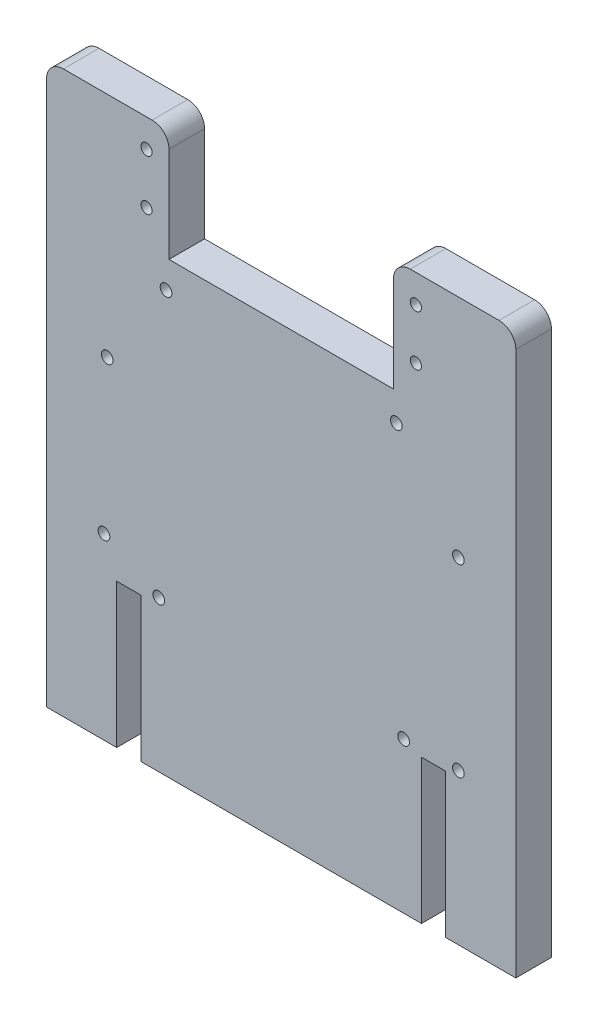
ISO-10303-21;
HEADER;
FILE_DESCRIPTION(('STEP AP214'),'2;1');
FILE_NAME('part.step','',(''),(''),'','','');
FILE_SCHEMA(('AUTOMOTIVE_DESIGN { 1 0 10303 214 1 1 1 1 }'));
ENDSEC;
DATA;
#1=APPLICATION_CONTEXT('core data for automotive mechanical design processes');
#2=APPLICATION_PROTOCOL_DEFINITION('international standard','automotive_design',2000,#1);
#3=PRODUCT_CONTEXT('',#1,'mechanical');
#4=PRODUCT('Part','Part','',(#3));
#5=PRODUCT_RELATED_PRODUCT_CATEGORY('part','',(#4));
#6=PRODUCT_DEFINITION_FORMATION('','',#4);
#7=PRODUCT_DEFINITION_CONTEXT('part definition',#1,'design');
#8=PRODUCT_DEFINITION('design','',#6,#7);
#9=PRODUCT_DEFINITION_SHAPE('','',#8);
#10=(LENGTH_UNIT() NAMED_UNIT(*) SI_UNIT(.MILLI.,.METRE.));
#11=(NAMED_UNIT(*) PLANE_ANGLE_UNIT() SI_UNIT($,.RADIAN.));
#12=(NAMED_UNIT(*) SI_UNIT($,.STERADIAN.) SOLID_ANGLE_UNIT());
#13=UNCERTAINTY_MEASURE_WITH_UNIT(LENGTH_MEASURE(1.E-05),#10,'distance_accuracy_value','');
#14=(GEOMETRIC_REPRESENTATION_CONTEXT(3) GLOBAL_UNCERTAINTY_ASSIGNED_CONTEXT((#13)) GLOBAL_UNIT_ASSIGNED_CONTEXT((#10,
#11,#12)) REPRESENTATION_CONTEXT('',''));
#15=CARTESIAN_POINT('',(0.,0.,0.));
#16=DIRECTION('',(0.,0.,1.));
#17=DIRECTION('',(1.,0.,0.));
#18=AXIS2_PLACEMENT_3D('',#15,#16,#17);
#19=CARTESIAN_POINT('',(12.5,0.,6.35));
#20=DIRECTION('',(0.,1.,0.));
#21=DIRECTION('',(-1.,0.,0.));
#22=AXIS2_PLACEMENT_3D('',#19,#20,#21);
#23=PLANE('',#22);
#24=DIRECTION('',(1.,0.,0.));
#25=VECTOR('',#24,1.);
#26=CARTESIAN_POINT('',(12.5,0.,0.));
#27=LINE('',#26,#25);
#28=CARTESIAN_POINT('',(0.,0.,0.));
#29=VERTEX_POINT('',#28);
#30=CARTESIAN_POINT('',(12.5,0.,0.));
#31=VERTEX_POINT('',#30);
#32=EDGE_CURVE('E200',#29,#31,#27,.T.);
#33=ORIENTED_EDGE('',*,*,#32,.T.);
#34=DIRECTION('',(0.,0.,-1.));
#35=VECTOR('',#34,1.);
#36=CARTESIAN_POINT('',(12.5,0.,6.35));
#37=LINE('',#36,#35);
#38=CARTESIAN_POINT('',(12.5,0.,6.35));
#39=VERTEX_POINT('',#38);
#40=EDGE_CURVE('E182',#39,#31,#37,.T.);
#41=ORIENTED_EDGE('',*,*,#40,.F.);
#42=DIRECTION('',(1.,0.,0.));
#43=VECTOR('',#42,1.);
#44=CARTESIAN_POINT('',(12.5,0.,6.35));
#45=LINE('',#44,#43);
#46=CARTESIAN_POINT('',(0.,0.,6.35));
#47=VERTEX_POINT('',#46);
#48=EDGE_CURVE('E188',#47,#39,#45,.T.);
#49=ORIENTED_EDGE('',*,*,#48,.F.);
#50=DIRECTION('',(0.,0.,-1.));
#51=VECTOR('',#50,1.);
#52=CARTESIAN_POINT('',(0.,0.,6.35));
#53=LINE('',#52,#51);
#54=EDGE_CURVE('E336',#47,#29,#53,.T.);
#55=ORIENTED_EDGE('',*,*,#54,.T.);
#56=EDGE_LOOP('',(#33,#41,#49,#55));
#57=FACE_BOUND('',#56,.T.);
#58=ADVANCED_FACE('F37',(#57),#23,.F.);
#59=CARTESIAN_POINT('',(12.5,0.,6.35));
#60=DIRECTION('',(-1.,0.,0.));
#61=DIRECTION('',(0.,0.,1.));
#62=AXIS2_PLACEMENT_3D('',#59,#60,#61);
#63=PLANE('',#62);
#64=DIRECTION('',(0.,1.,0.));
#65=VECTOR('',#64,1.);
#66=CARTESIAN_POINT('',(12.5,0.,0.));
#67=LINE('',#66,#65);
#68=CARTESIAN_POINT('',(12.5,25.68,0.));
#69=VERTEX_POINT('',#68);
#70=EDGE_CURVE('E338',#31,#69,#67,.T.);
#71=ORIENTED_EDGE('',*,*,#70,.T.);
#72=DIRECTION('',(0.,0.,-1.));
#73=VECTOR('',#72,1.);
#74=CARTESIAN_POINT('',(12.5,25.68,6.35));
#75=LINE('',#74,#73);
#76=CARTESIAN_POINT('',(12.5,25.68,6.35));
#77=VERTEX_POINT('',#76);
#78=EDGE_CURVE('E185',#77,#69,#75,.T.);
#79=ORIENTED_EDGE('',*,*,#78,.F.);
#80=DIRECTION('',(0.,1.,0.));
#81=VECTOR('',#80,1.);
#82=CARTESIAN_POINT('',(12.5,0.,6.35));
#83=LINE('',#82,#81);
#84=EDGE_CURVE('E178',#39,#77,#83,.T.);
#85=ORIENTED_EDGE('',*,*,#84,.F.);
#86=ORIENTED_EDGE('',*,*,#40,.T.);
#87=EDGE_LOOP('',(#71,#79,#85,#86));
#88=FACE_BOUND('',#87,.T.);
#89=ADVANCED_FACE('F180',(#88),#63,.F.);
#90=CARTESIAN_POINT('',(12.5,25.68,6.35));
#91=DIRECTION('',(0.,1.,0.));
#92=DIRECTION('',(0.,0.,1.));
#93=AXIS2_PLACEMENT_3D('',#90,#91,#92);
#94=PLANE('',#93);
#95=DIRECTION('',(1.,0.,0.));
#96=VECTOR('',#95,1.);
#97=CARTESIAN_POINT('',(12.5,25.68,0.));
#98=LINE('',#97,#96);
#99=CARTESIAN_POINT('',(16.818,25.68,0.));
#100=VERTEX_POINT('',#99);
#101=EDGE_CURVE('E340',#69,#100,#98,.T.);
#102=ORIENTED_EDGE('',*,*,#101,.T.);
#103=DIRECTION('',(0.,0.,-1.));
#104=VECTOR('',#103,1.);
#105=CARTESIAN_POINT('',(16.818,25.68,6.35));
#106=LINE('',#105,#104);
#107=CARTESIAN_POINT('',(16.818,25.68,6.35));
#108=VERTEX_POINT('',#107);
#109=EDGE_CURVE('E205',#108,#100,#106,.T.);
#110=ORIENTED_EDGE('',*,*,#109,.F.);
#111=DIRECTION('',(1.,0.,0.));
#112=VECTOR('',#111,1.);
#113=CARTESIAN_POINT('',(12.5,25.68,6.35));
#114=LINE('',#113,#112);
#115=EDGE_CURVE('E187',#77,#108,#114,.T.);
#116=ORIENTED_EDGE('',*,*,#115,.F.);
#117=ORIENTED_EDGE('',*,*,#78,.T.);
#118=EDGE_LOOP('',(#102,#110,#116,#117));
#119=FACE_BOUND('',#118,.T.);
#120=ADVANCED_FACE('F419',(#119),#94,.F.);
#121=CARTESIAN_POINT('',(16.818,25.68,6.35));
#122=DIRECTION('',(1.,0.,0.));
#123=DIRECTION('',(0.,0.,-1.));
#124=AXIS2_PLACEMENT_3D('',#121,#122,#123);
#125=PLANE('',#124);
#126=DIRECTION('',(0.,-1.,0.));
#127=VECTOR('',#126,1.);
#128=CARTESIAN_POINT('',(16.818,25.68,0.));
#129=LINE('',#128,#127);
#130=CARTESIAN_POINT('',(16.818,0.,0.));
#131=VERTEX_POINT('',#130);
#132=EDGE_CURVE('E342',#100,#131,#129,.T.);
#133=ORIENTED_EDGE('',*,*,#132,.T.);
#134=DIRECTION('',(0.,0.,-1.));
#135=VECTOR('',#134,1.);
#136=CARTESIAN_POINT('',(16.818,0.,6.35));
#137=LINE('',#136,#135);
#138=CARTESIAN_POINT('',(16.818,0.,6.35));
#139=VERTEX_POINT('',#138);
#140=EDGE_CURVE('E392',#139,#131,#137,.T.);
#141=ORIENTED_EDGE('',*,*,#140,.F.);
#142=DIRECTION('',(0.,-1.,0.));
#143=VECTOR('',#142,1.);
#144=CARTESIAN_POINT('',(16.818,25.68,6.35));
#145=LINE('',#144,#143);
#146=EDGE_CURVE('E309',#108,#139,#145,.T.);
#147=ORIENTED_EDGE('',*,*,#146,.F.);
#148=ORIENTED_EDGE('',*,*,#109,.T.);
#149=EDGE_LOOP('',(#133,#141,#147,#148));
#150=FACE_BOUND('',#149,.T.);
#151=ADVANCED_FACE('F399',(#150),#125,.F.);
#152=CARTESIAN_POINT('',(16.818,0.,6.35));
#153=DIRECTION('',(0.,1.,0.));
#154=DIRECTION('',(0.,0.,1.));
#155=AXIS2_PLACEMENT_3D('',#152,#153,#154);
#156=PLANE('',#155);
#157=DIRECTION('',(1.,0.,0.));
#158=VECTOR('',#157,1.);
#159=CARTESIAN_POINT('',(16.818,0.,0.));
#160=LINE('',#159,#158);
#161=CARTESIAN_POINT('',(66.818,0.,0.));
#162=VERTEX_POINT('',#161);
#163=EDGE_CURVE('E344',#131,#162,#160,.T.);
#164=ORIENTED_EDGE('',*,*,#163,.T.);
#165=DIRECTION('',(0.,0.,-1.));
#166=VECTOR('',#165,1.);
#167=CARTESIAN_POINT('',(66.818,0.,6.35));
#168=LINE('',#167,#166);
#169=CARTESIAN_POINT('',(66.818,0.,6.35));
#170=VERTEX_POINT('',#169);
#171=EDGE_CURVE('E389',#170,#162,#168,.T.);
#172=ORIENTED_EDGE('',*,*,#171,.F.);
#173=DIRECTION('',(1.,0.,0.));
#174=VECTOR('',#173,1.);
#175=CARTESIAN_POINT('',(16.818,0.,6.35));
#176=LINE('',#175,#174);
#177=EDGE_CURVE('E311',#139,#170,#176,.T.);
#178=ORIENTED_EDGE('',*,*,#177,.F.);
#179=ORIENTED_EDGE('',*,*,#140,.T.);
#180=EDGE_LOOP('',(#164,#172,#178,#179));
#181=FACE_BOUND('',#180,.T.);
#182=ADVANCED_FACE('F411',(#181),#156,.F.);
#183=CARTESIAN_POINT('',(66.818,0.,6.35));
#184=DIRECTION('',(-1.,0.,0.));
#185=DIRECTION('',(0.,0.,1.));
#186=AXIS2_PLACEMENT_3D('',#183,#184,#185);
#187=PLANE('',#186);
#188=DIRECTION('',(0.,1.,0.));
#189=VECTOR('',#188,1.);
#190=CARTESIAN_POINT('',(66.818,0.,0.));
#191=LINE('',#190,#189);
#192=CARTESIAN_POINT('',(66.818,25.68,0.));
#193=VERTEX_POINT('',#192);
#194=EDGE_CURVE('E346',#162,#193,#191,.T.);
#195=ORIENTED_EDGE('',*,*,#194,.T.);
#196=DIRECTION('',(0.,0.,-1.));
#197=VECTOR('',#196,1.);
#198=CARTESIAN_POINT('',(66.818,25.68,6.35));
#199=LINE('',#198,#197);
#200=CARTESIAN_POINT('',(66.818,25.68,6.35));
#201=VERTEX_POINT('',#200);
#202=EDGE_CURVE('E386',#201,#193,#199,.T.);
#203=ORIENTED_EDGE('',*,*,#202,.F.);
#204=DIRECTION('',(0.,1.,0.));
#205=VECTOR('',#204,1.);
#206=CARTESIAN_POINT('',(66.818,0.,6.35));
#207=LINE('',#206,#205);
#208=EDGE_CURVE('E313',#170,#201,#207,.T.);
#209=ORIENTED_EDGE('',*,*,#208,.F.);
#210=ORIENTED_EDGE('',*,*,#171,.T.);
#211=EDGE_LOOP('',(#195,#203,#209,#210));
#212=FACE_BOUND('',#211,.T.);
#213=ADVANCED_FACE('F415',(#212),#187,.F.);
#214=CARTESIAN_POINT('',(66.818,25.68,6.35));
#215=DIRECTION('',(0.,1.,0.));
#216=DIRECTION('',(0.,0.,1.));
#217=AXIS2_PLACEMENT_3D('',#214,#215,#216);
#218=PLANE('',#217);
#219=DIRECTION('',(1.,0.,0.));
#220=VECTOR('',#219,1.);
#221=CARTESIAN_POINT('',(66.818,25.68,0.));
#222=LINE('',#221,#220);
#223=CARTESIAN_POINT('',(71.136,25.68,0.));
#224=VERTEX_POINT('',#223);
#225=EDGE_CURVE('E348',#193,#224,#222,.T.);
#226=ORIENTED_EDGE('',*,*,#225,.T.);
#227=DIRECTION('',(0.,0.,-1.));
#228=VECTOR('',#227,1.);
#229=CARTESIAN_POINT('',(71.136,25.68,6.35));
#230=LINE('',#229,#228);
#231=CARTESIAN_POINT('',(71.136,25.68,6.35));
#232=VERTEX_POINT('',#231);
#233=EDGE_CURVE('E383',#232,#224,#230,.T.);
#234=ORIENTED_EDGE('',*,*,#233,.F.);
#235=DIRECTION('',(1.,0.,0.));
#236=VECTOR('',#235,1.);
#237=CARTESIAN_POINT('',(66.818,25.68,6.35));
#238=LINE('',#237,#236);
#239=EDGE_CURVE('E315',#201,#232,#238,.T.);
#240=ORIENTED_EDGE('',*,*,#239,.F.);
#241=ORIENTED_EDGE('',*,*,#202,.T.);
#242=EDGE_LOOP('',(#226,#234,#240,#241));
#243=FACE_BOUND('',#242,.T.);
#244=ADVANCED_FACE('F497',(#243),#218,.F.);
#245=CARTESIAN_POINT('',(71.136,25.68,6.35));
#246=DIRECTION('',(1.,0.,0.));
#247=DIRECTION('',(0.,0.,-1.));
#248=AXIS2_PLACEMENT_3D('',#245,#246,#247);
#249=PLANE('',#248);
#250=DIRECTION('',(0.,-1.,0.));
#251=VECTOR('',#250,1.);
#252=CARTESIAN_POINT('',(71.136,25.68,0.));
#253=LINE('',#252,#251);
#254=CARTESIAN_POINT('',(71.136,0.,0.));
#255=VERTEX_POINT('',#254);
#256=EDGE_CURVE('E350',#224,#255,#253,.T.);
#257=ORIENTED_EDGE('',*,*,#256,.T.);
#258=DIRECTION('',(0.,0.,-1.));
#259=VECTOR('',#258,1.);
#260=CARTESIAN_POINT('',(71.136,0.,6.35));
#261=LINE('',#260,#259);
#262=CARTESIAN_POINT('',(71.136,0.,6.35));
#263=VERTEX_POINT('',#262);
#264=EDGE_CURVE('E380',#263,#255,#261,.T.);
#265=ORIENTED_EDGE('',*,*,#264,.F.);
#266=DIRECTION('',(0.,-1.,0.));
#267=VECTOR('',#266,1.);
#268=CARTESIAN_POINT('',(71.136,25.68,6.35));
#269=LINE('',#268,#267);
#270=EDGE_CURVE('E317',#232,#263,#269,.T.);
#271=ORIENTED_EDGE('',*,*,#270,.F.);
#272=ORIENTED_EDGE('',*,*,#233,.T.);
#273=EDGE_LOOP('',(#257,#265,#271,#272));
#274=FACE_BOUND('',#273,.T.);
#275=ADVANCED_FACE('F493',(#274),#249,.F.);
#276=CARTESIAN_POINT('',(71.136,0.,6.35));
#277=DIRECTION('',(0.,1.,0.));
#278=DIRECTION('',(0.,0.,1.));
#279=AXIS2_PLACEMENT_3D('',#276,#277,#278);
#280=PLANE('',#279);
#281=DIRECTION('',(1.,0.,0.));
#282=VECTOR('',#281,1.);
#283=CARTESIAN_POINT('',(71.136,0.,0.));
#284=LINE('',#283,#282);
#285=CARTESIAN_POINT('',(83.636,0.,0.));
#286=VERTEX_POINT('',#285);
#287=EDGE_CURVE('E352',#255,#286,#284,.T.);
#288=ORIENTED_EDGE('',*,*,#287,.T.);
#289=DIRECTION('',(0.,0.,-1.));
#290=VECTOR('',#289,1.);
#291=CARTESIAN_POINT('',(83.636,0.,6.35));
#292=LINE('',#291,#290);
#293=CARTESIAN_POINT('',(83.636,0.,6.35));
#294=VERTEX_POINT('',#293);
#295=EDGE_CURVE('E377',#294,#286,#292,.T.);
#296=ORIENTED_EDGE('',*,*,#295,.F.);
#297=DIRECTION('',(1.,0.,0.));
#298=VECTOR('',#297,1.);
#299=CARTESIAN_POINT('',(71.136,0.,6.35));
#300=LINE('',#299,#298);
#301=EDGE_CURVE('E319',#263,#294,#300,.T.);
#302=ORIENTED_EDGE('',*,*,#301,.F.);
#303=ORIENTED_EDGE('',*,*,#264,.T.);
#304=EDGE_LOOP('',(#288,#296,#302,#303));
#305=FACE_BOUND('',#304,.T.);
#306=ADVANCED_FACE('F489',(#305),#280,.F.);
#307=CARTESIAN_POINT('',(83.636,100.,6.35));
#308=DIRECTION('',(-1.,0.,0.));
#309=DIRECTION('',(0.,0.,1.));
#310=AXIS2_PLACEMENT_3D('',#307,#308,#309);
#311=PLANE('',#310);
#312=DIRECTION('',(0.,1.,0.));
#313=VECTOR('',#312,1.);
#314=CARTESIAN_POINT('',(83.636,100.,0.));
#315=LINE('',#314,#313);
#316=CARTESIAN_POINT('',(83.636,97.,0.));
#317=VERTEX_POINT('',#316);
#318=EDGE_CURVE('E354',#286,#317,#315,.T.);
#319=ORIENTED_EDGE('',*,*,#318,.T.);
#320=DIRECTION('',(0.,0.,-1.));
#321=VECTOR('',#320,1.);
#322=CARTESIAN_POINT('',(83.636,97.,6.35));
#323=LINE('',#322,#321);
#324=CARTESIAN_POINT('',(83.636,97.,6.35));
#325=VERTEX_POINT('',#324);
#326=EDGE_CURVE('E219',#317,#325,#323,.F.);
#327=ORIENTED_EDGE('',*,*,#326,.T.);
#328=DIRECTION('',(0.,1.,0.));
#329=VECTOR('',#328,1.);
#330=CARTESIAN_POINT('',(83.636,100.,6.35));
#331=LINE('',#330,#329);
#332=EDGE_CURVE('E321',#294,#325,#331,.T.);
#333=ORIENTED_EDGE('',*,*,#332,.F.);
#334=ORIENTED_EDGE('',*,*,#295,.T.);
#335=EDGE_LOOP('',(#319,#327,#333,#334));
#336=FACE_BOUND('',#335,.T.);
#337=ADVANCED_FACE('F485',(#336),#311,.F.);
#338=CARTESIAN_POINT('',(61.818,100.,6.35));
#339=DIRECTION('',(0.,-1.,0.));
#340=DIRECTION('',(1.,0.,0.));
#341=AXIS2_PLACEMENT_3D('',#338,#339,#340);
#342=PLANE('',#341);
#343=DIRECTION('',(-1.,0.,0.));
#344=VECTOR('',#343,1.);
#345=CARTESIAN_POINT('',(61.818,100.,6.35));
#346=LINE('',#345,#344);
#347=CARTESIAN_POINT('',(80.636,100.,6.35));
#348=VERTEX_POINT('',#347);
#349=CARTESIAN_POINT('',(64.818,100.,6.35));
#350=VERTEX_POINT('',#349);
#351=EDGE_CURVE('E323',#348,#350,#346,.T.);
#352=ORIENTED_EDGE('',*,*,#351,.F.);
#353=DIRECTION('',(0.,0.,-1.));
#354=VECTOR('',#353,1.);
#355=CARTESIAN_POINT('',(80.636,100.,6.35));
#356=LINE('',#355,#354);
#357=CARTESIAN_POINT('',(80.636,100.,0.));
#358=VERTEX_POINT('',#357);
#359=EDGE_CURVE('E203',#348,#358,#356,.T.);
#360=ORIENTED_EDGE('',*,*,#359,.T.);
#361=DIRECTION('',(-1.,0.,0.));
#362=VECTOR('',#361,1.);
#363=CARTESIAN_POINT('',(61.818,100.,0.));
#364=LINE('',#363,#362);
#365=CARTESIAN_POINT('',(64.818,100.,0.));
#366=VERTEX_POINT('',#365);
#367=EDGE_CURVE('E357',#358,#366,#364,.T.);
#368=ORIENTED_EDGE('',*,*,#367,.T.);
#369=DIRECTION('',(0.,0.,-1.));
#370=VECTOR('',#369,1.);
#371=CARTESIAN_POINT('',(64.818,100.,6.35));
#372=LINE('',#371,#370);
#373=EDGE_CURVE('E201',#366,#350,#372,.F.);
#374=ORIENTED_EDGE('',*,*,#373,.T.);
#375=EDGE_LOOP('',(#352,#360,#368,#374));
#376=FACE_BOUND('',#375,.T.);
#377=ADVANCED_FACE('F481',(#376),#342,.F.);
#378=CARTESIAN_POINT('',(61.818,80.,6.35));
#379=DIRECTION('',(1.,0.,0.));
#380=DIRECTION('',(0.,0.,-1.));
#381=AXIS2_PLACEMENT_3D('',#378,#379,#380);
#382=PLANE('',#381);
#383=DIRECTION('',(0.,-1.,0.));
#384=VECTOR('',#383,1.);
#385=CARTESIAN_POINT('',(61.818,80.,6.35));
#386=LINE('',#385,#384);
#387=CARTESIAN_POINT('',(61.818,97.,6.35));
#388=VERTEX_POINT('',#387);
#389=CARTESIAN_POINT('',(61.818,80.,6.35));
#390=VERTEX_POINT('',#389);
#391=EDGE_CURVE('E326',#388,#390,#386,.T.);
#392=ORIENTED_EDGE('',*,*,#391,.F.);
#393=DIRECTION('',(0.,0.,-1.));
#394=VECTOR('',#393,1.);
#395=CARTESIAN_POINT('',(61.818,97.,6.35));
#396=LINE('',#395,#394);
#397=CARTESIAN_POINT('',(61.818,97.,0.));
#398=VERTEX_POINT('',#397);
#399=EDGE_CURVE('E228',#388,#398,#396,.T.);
#400=ORIENTED_EDGE('',*,*,#399,.T.);
#401=DIRECTION('',(0.,-1.,0.));
#402=VECTOR('',#401,1.);
#403=CARTESIAN_POINT('',(61.818,80.,0.));
#404=LINE('',#403,#402);
#405=CARTESIAN_POINT('',(61.818,80.,0.));
#406=VERTEX_POINT('',#405);
#407=EDGE_CURVE('E360',#398,#406,#404,.T.);
#408=ORIENTED_EDGE('',*,*,#407,.T.);
#409=DIRECTION('',(0.,0.,-1.));
#410=VECTOR('',#409,1.);
#411=CARTESIAN_POINT('',(61.818,80.,6.35));
#412=LINE('',#411,#410);
#413=EDGE_CURVE('E374',#390,#406,#412,.T.);
#414=ORIENTED_EDGE('',*,*,#413,.F.);
#415=EDGE_LOOP('',(#392,#400,#408,#414));
#416=FACE_BOUND('',#415,.T.);
#417=ADVANCED_FACE('F477',(#416),#382,.F.);
#418=CARTESIAN_POINT('',(21.818,80.,6.35));
#419=DIRECTION('',(0.,-1.,0.));
#420=DIRECTION('',(0.,0.,-1.));
#421=AXIS2_PLACEMENT_3D('',#418,#419,#420);
#422=PLANE('',#421);
#423=DIRECTION('',(-1.,0.,0.));
#424=VECTOR('',#423,1.);
#425=CARTESIAN_POINT('',(21.818,80.,0.));
#426=LINE('',#425,#424);
#427=CARTESIAN_POINT('',(21.818,80.,0.));
#428=VERTEX_POINT('',#427);
#429=EDGE_CURVE('E362',#406,#428,#426,.T.);
#430=ORIENTED_EDGE('',*,*,#429,.T.);
#431=DIRECTION('',(0.,0.,-1.));
#432=VECTOR('',#431,1.);
#433=CARTESIAN_POINT('',(21.818,80.,6.35));
#434=LINE('',#433,#432);
#435=CARTESIAN_POINT('',(21.818,80.,6.35));
#436=VERTEX_POINT('',#435);
#437=EDGE_CURVE('E371',#436,#428,#434,.T.);
#438=ORIENTED_EDGE('',*,*,#437,.F.);
#439=DIRECTION('',(-1.,0.,0.));
#440=VECTOR('',#439,1.);
#441=CARTESIAN_POINT('',(21.818,80.,6.35));
#442=LINE('',#441,#440);
#443=EDGE_CURVE('E328',#390,#436,#442,.T.);
#444=ORIENTED_EDGE('',*,*,#443,.F.);
#445=ORIENTED_EDGE('',*,*,#413,.T.);
#446=EDGE_LOOP('',(#430,#438,#444,#445));
#447=FACE_BOUND('',#446,.T.);
#448=ADVANCED_FACE('F473',(#447),#422,.F.);
#449=CARTESIAN_POINT('',(21.818,100.,6.35));
#450=DIRECTION('',(-1.,0.,0.));
#451=DIRECTION('',(0.,0.,1.));
#452=AXIS2_PLACEMENT_3D('',#449,#450,#451);
#453=PLANE('',#452);
#454=DIRECTION('',(0.,1.,0.));
#455=VECTOR('',#454,1.);
#456=CARTESIAN_POINT('',(21.818,100.,0.));
#457=LINE('',#456,#455);
#458=CARTESIAN_POINT('',(21.818,97.,0.));
#459=VERTEX_POINT('',#458);
#460=EDGE_CURVE('E364',#428,#459,#457,.T.);
#461=ORIENTED_EDGE('',*,*,#460,.T.);
#462=DIRECTION('',(0.,0.,-1.));
#463=VECTOR('',#462,1.);
#464=CARTESIAN_POINT('',(21.818,97.,6.35));
#465=LINE('',#464,#463);
#466=CARTESIAN_POINT('',(21.818,97.,6.35));
#467=VERTEX_POINT('',#466);
#468=EDGE_CURVE('E46',#459,#467,#465,.F.);
#469=ORIENTED_EDGE('',*,*,#468,.T.);
#470=DIRECTION('',(0.,1.,0.));
#471=VECTOR('',#470,1.);
#472=CARTESIAN_POINT('',(21.818,100.,6.35));
#473=LINE('',#472,#471);
#474=EDGE_CURVE('E330',#436,#467,#473,.T.);
#475=ORIENTED_EDGE('',*,*,#474,.F.);
#476=ORIENTED_EDGE('',*,*,#437,.T.);
#477=EDGE_LOOP('',(#461,#469,#475,#476));
#478=FACE_BOUND('',#477,.T.);
#479=ADVANCED_FACE('F467',(#478),#453,.F.);
#480=CARTESIAN_POINT('',(0.,100.,6.35));
#481=DIRECTION('',(0.,-1.,0.));
#482=DIRECTION('',(0.,0.,-1.));
#483=AXIS2_PLACEMENT_3D('',#480,#481,#482);
#484=PLANE('',#483);
#485=DIRECTION('',(-1.,0.,0.));
#486=VECTOR('',#485,1.);
#487=CARTESIAN_POINT('',(0.,100.,6.35));
#488=LINE('',#487,#486);
#489=CARTESIAN_POINT('',(18.818,100.,6.35));
#490=VERTEX_POINT('',#489);
#491=CARTESIAN_POINT('',(3.,100.,6.35));
#492=VERTEX_POINT('',#491);
#493=EDGE_CURVE('E333',#490,#492,#488,.T.);
#494=ORIENTED_EDGE('',*,*,#493,.F.);
#495=DIRECTION('',(0.,0.,-1.));
#496=VECTOR('',#495,1.);
#497=CARTESIAN_POINT('',(18.818,100.,6.35));
#498=LINE('',#497,#496);
#499=CARTESIAN_POINT('',(18.818,100.,0.));
#500=VERTEX_POINT('',#499);
#501=EDGE_CURVE('E232',#490,#500,#498,.T.);
#502=ORIENTED_EDGE('',*,*,#501,.T.);
#503=DIRECTION('',(-1.,0.,0.));
#504=VECTOR('',#503,1.);
#505=CARTESIAN_POINT('',(0.,100.,0.));
#506=LINE('',#505,#504);
#507=CARTESIAN_POINT('',(3.,100.,0.));
#508=VERTEX_POINT('',#507);
#509=EDGE_CURVE('E367',#500,#508,#506,.T.);
#510=ORIENTED_EDGE('',*,*,#509,.T.);
#511=DIRECTION('',(0.,0.,-1.));
#512=VECTOR('',#511,1.);
#513=CARTESIAN_POINT('',(3.,100.,6.35));
#514=LINE('',#513,#512);
#515=EDGE_CURVE('E62',#508,#492,#514,.F.);
#516=ORIENTED_EDGE('',*,*,#515,.T.);
#517=EDGE_LOOP('',(#494,#502,#510,#516));
#518=FACE_BOUND('',#517,.T.);
#519=ADVANCED_FACE('F452',(#518),#484,.F.);
#520=CARTESIAN_POINT('',(0.,0.,6.35));
#521=DIRECTION('',(1.,0.,0.));
#522=DIRECTION('',(0.,1.,0.));
#523=AXIS2_PLACEMENT_3D('',#520,#521,#522);
#524=PLANE('',#523);
#525=DIRECTION('',(0.,-1.,0.));
#526=VECTOR('',#525,1.);
#527=CARTESIAN_POINT('',(0.,0.,6.35));
#528=LINE('',#527,#526);
#529=CARTESIAN_POINT('',(0.,97.,6.35));
#530=VERTEX_POINT('',#529);
#531=EDGE_CURVE('E193',#530,#47,#528,.T.);
#532=ORIENTED_EDGE('',*,*,#531,.F.);
#533=DIRECTION('',(0.,0.,-1.));
#534=VECTOR('',#533,1.);
#535=CARTESIAN_POINT('',(0.,97.,6.35));
#536=LINE('',#535,#534);
#537=CARTESIAN_POINT('',(0.,97.,0.));
#538=VERTEX_POINT('',#537);
#539=EDGE_CURVE('E11',#530,#538,#536,.T.);
#540=ORIENTED_EDGE('',*,*,#539,.T.);
#541=DIRECTION('',(0.,-1.,0.));
#542=VECTOR('',#541,1.);
#543=CARTESIAN_POINT('',(0.,0.,0.));
#544=LINE('',#543,#542);
#545=EDGE_CURVE('E197',#538,#29,#544,.T.);
#546=ORIENTED_EDGE('',*,*,#545,.T.);
#547=ORIENTED_EDGE('',*,*,#54,.F.);
#548=EDGE_LOOP('',(#532,#540,#546,#547));
#549=FACE_BOUND('',#548,.T.);
#550=ADVANCED_FACE('F458',(#549),#524,.F.);
#551=CARTESIAN_POINT('',(0.,0.,6.35));
#552=DIRECTION('',(0.,0.,-1.));
#553=DIRECTION('',(-1.,0.,0.));
#554=AXIS2_PLACEMENT_3D('',#551,#552,#553);
#555=PLANE('',#554);
#556=CARTESIAN_POINT('',(21.3,75.,6.35));
#557=DIRECTION('',(0.,0.,1.));
#558=DIRECTION('',(1.,0.,0.));
#559=AXIS2_PLACEMENT_3D('',#556,#557,#558);
#560=CIRCLE('',#559,1.0414);
#561=CARTESIAN_POINT('',(22.3414,75.,6.35));
#562=VERTEX_POINT('',#561);
#563=EDGE_CURVE('E287',#562,#562,#560,.T.);
#564=ORIENTED_EDGE('',*,*,#563,.F.);
#565=EDGE_LOOP('',(#564));
#566=FACE_BOUND('',#565,.T.);
#567=CARTESIAN_POINT('',(20.,26.9,6.35));
#568=DIRECTION('',(0.,0.,1.));
#569=DIRECTION('',(1.,0.,0.));
#570=AXIS2_PLACEMENT_3D('',#567,#568,#569);
#571=CIRCLE('',#570,1.0414);
#572=CARTESIAN_POINT('',(21.0414,26.9,6.35));
#573=VERTEX_POINT('',#572);
#574=EDGE_CURVE('E277',#573,#573,#571,.T.);
#575=ORIENTED_EDGE('',*,*,#574,.F.);
#576=EDGE_LOOP('',(#575));
#577=FACE_BOUND('',#576,.T.);
#578=CARTESIAN_POINT('',(73.4,26.9,6.35));
#579=DIRECTION('',(0.,0.,1.));
#580=DIRECTION('',(1.,0.,0.));
#581=AXIS2_PLACEMENT_3D('',#578,#579,#580);
#582=CIRCLE('',#581,1.0414);
#583=CARTESIAN_POINT('',(74.4414,26.9,6.35));
#584=VERTEX_POINT('',#583);
#585=EDGE_CURVE('E274',#584,#584,#582,.T.);
#586=ORIENTED_EDGE('',*,*,#585,.F.);
#587=EDGE_LOOP('',(#586));
#588=FACE_BOUND('',#587,.T.);
#589=CARTESIAN_POINT('',(73.4,59.8,6.35));
#590=DIRECTION('',(0.,0.,1.));
#591=DIRECTION('',(1.,0.,0.));
#592=AXIS2_PLACEMENT_3D('',#589,#590,#591);
#593=CIRCLE('',#592,1.0414);
#594=CARTESIAN_POINT('',(74.4414,59.8,6.35));
#595=VERTEX_POINT('',#594);
#596=EDGE_CURVE('E271',#595,#595,#593,.T.);
#597=ORIENTED_EDGE('',*,*,#596,.F.);
#598=EDGE_LOOP('',(#597));
#599=FACE_BOUND('',#598,.T.);
#600=CARTESIAN_POINT('',(10.236,31.9,6.35));
#601=DIRECTION('',(0.,0.,1.));
#602=DIRECTION('',(1.,0.,0.));
#603=AXIS2_PLACEMENT_3D('',#600,#601,#602);
#604=CIRCLE('',#603,1.0414);
#605=CARTESIAN_POINT('',(11.2774,31.9,6.35));
#606=VERTEX_POINT('',#605);
#607=EDGE_CURVE('E267',#606,#606,#604,.T.);
#608=ORIENTED_EDGE('',*,*,#607,.F.);
#609=EDGE_LOOP('',(#608));
#610=FACE_BOUND('',#609,.T.);
#611=CARTESIAN_POINT('',(63.636,26.9,6.35));
#612=DIRECTION('',(0.,0.,1.));
#613=DIRECTION('',(1.,0.,0.));
#614=AXIS2_PLACEMENT_3D('',#611,#612,#613);
#615=CIRCLE('',#614,1.0414);
#616=CARTESIAN_POINT('',(64.6774,26.9,6.35));
#617=VERTEX_POINT('',#616);
#618=EDGE_CURVE('E263',#617,#617,#615,.T.);
#619=ORIENTED_EDGE('',*,*,#618,.F.);
#620=EDGE_LOOP('',(#619));
#621=FACE_BOUND('',#620,.T.);
#622=CARTESIAN_POINT('',(62.336,75.,6.35));
#623=DIRECTION('',(0.,0.,1.));
#624=DIRECTION('',(1.,0.,0.));
#625=AXIS2_PLACEMENT_3D('',#622,#623,#624);
#626=CIRCLE('',#625,1.0414);
#627=CARTESIAN_POINT('',(63.3774,75.,6.35));
#628=VERTEX_POINT('',#627);
#629=EDGE_CURVE('E259',#628,#628,#626,.T.);
#630=ORIENTED_EDGE('',*,*,#629,.F.);
#631=EDGE_LOOP('',(#630));
#632=FACE_BOUND('',#631,.T.);
#633=CARTESIAN_POINT('',(10.811692827815,59.3939235360281,6.35));
#634=DIRECTION('',(0.,0.,1.));
#635=DIRECTION('',(1.,0.,0.));
#636=AXIS2_PLACEMENT_3D('',#633,#634,#635);
#637=CIRCLE('',#636,1.0414);
#638=CARTESIAN_POINT('',(11.853092827815,59.3939235360281,6.35));
#639=VERTEX_POINT('',#638);
#640=EDGE_CURVE('E255',#639,#639,#637,.T.);
#641=ORIENTED_EDGE('',*,*,#640,.F.);
#642=EDGE_LOOP('',(#641));
#643=FACE_BOUND('',#642,.T.);
#644=CARTESIAN_POINT('',(17.818,95.,6.35));
#645=DIRECTION('',(0.,0.,1.));
#646=DIRECTION('',(1.,0.,0.));
#647=AXIS2_PLACEMENT_3D('',#644,#645,#646);
#648=CIRCLE('',#647,0.99695);
#649=CARTESIAN_POINT('',(18.81495,95.,6.35));
#650=VERTEX_POINT('',#649);
#651=EDGE_CURVE('E251',#650,#650,#648,.T.);
#652=ORIENTED_EDGE('',*,*,#651,.F.);
#653=EDGE_LOOP('',(#652));
#654=FACE_BOUND('',#653,.T.);
#655=CARTESIAN_POINT('',(17.818,86.,6.35));
#656=DIRECTION('',(0.,0.,1.));
#657=DIRECTION('',(1.,0.,0.));
#658=AXIS2_PLACEMENT_3D('',#655,#656,#657);
#659=CIRCLE('',#658,0.99695);
#660=CARTESIAN_POINT('',(18.81495,86.,6.35));
#661=VERTEX_POINT('',#660);
#662=EDGE_CURVE('E247',#661,#661,#659,.T.);
#663=ORIENTED_EDGE('',*,*,#662,.F.);
#664=EDGE_LOOP('',(#663));
#665=FACE_BOUND('',#664,.T.);
#666=CARTESIAN_POINT('',(65.818,86.,6.35));
#667=DIRECTION('',(0.,0.,1.));
#668=DIRECTION('',(1.,0.,0.));
#669=AXIS2_PLACEMENT_3D('',#666,#667,#668);
#670=CIRCLE('',#669,0.996949999999996);
#671=CARTESIAN_POINT('',(66.81495,86.,6.35));
#672=VERTEX_POINT('',#671);
#673=EDGE_CURVE('E243',#672,#672,#670,.T.);
#674=ORIENTED_EDGE('',*,*,#673,.F.);
#675=EDGE_LOOP('',(#674));
#676=FACE_BOUND('',#675,.T.);
#677=CARTESIAN_POINT('',(65.818,95.,6.35));
#678=DIRECTION('',(0.,0.,1.));
#679=DIRECTION('',(1.,0.,0.));
#680=AXIS2_PLACEMENT_3D('',#677,#678,#679);
#681=CIRCLE('',#680,0.996949999999996);
#682=CARTESIAN_POINT('',(66.81495,95.,6.35));
#683=VERTEX_POINT('',#682);
#684=EDGE_CURVE('E239',#683,#683,#681,.T.);
#685=ORIENTED_EDGE('',*,*,#684,.F.);
#686=EDGE_LOOP('',(#685));
#687=FACE_BOUND('',#686,.T.);
#688=ORIENTED_EDGE('',*,*,#332,.T.);
#689=CARTESIAN_POINT('',(80.636,97.,6.35));
#690=DIRECTION('',(0.,0.,-1.));
#691=DIRECTION('',(-1.,0.,0.));
#692=AXIS2_PLACEMENT_3D('',#689,#690,#691);
#693=CIRCLE('',#692,3.);
#694=EDGE_CURVE('E226',#325,#348,#693,.F.);
#695=ORIENTED_EDGE('',*,*,#694,.T.);
#696=ORIENTED_EDGE('',*,*,#351,.T.);
#697=CARTESIAN_POINT('',(64.818,97.,6.35));
#698=DIRECTION('',(0.,0.,-1.));
#699=DIRECTION('',(-1.,0.,0.));
#700=AXIS2_PLACEMENT_3D('',#697,#698,#699);
#701=CIRCLE('',#700,3.);
#702=EDGE_CURVE('E224',#350,#388,#701,.F.);
#703=ORIENTED_EDGE('',*,*,#702,.T.);
#704=ORIENTED_EDGE('',*,*,#391,.T.);
#705=ORIENTED_EDGE('',*,*,#443,.T.);
#706=ORIENTED_EDGE('',*,*,#474,.T.);
#707=CARTESIAN_POINT('',(18.818,97.,6.35));
#708=DIRECTION('',(0.,0.,-1.));
#709=DIRECTION('',(-1.,0.,0.));
#710=AXIS2_PLACEMENT_3D('',#707,#708,#709);
#711=CIRCLE('',#710,3.);
#712=EDGE_CURVE('E222',#467,#490,#711,.F.);
#713=ORIENTED_EDGE('',*,*,#712,.T.);
#714=ORIENTED_EDGE('',*,*,#493,.T.);
#715=CARTESIAN_POINT('',(3.,97.,6.35));
#716=DIRECTION('',(0.,0.,-1.));
#717=DIRECTION('',(-1.,0.,0.));
#718=AXIS2_PLACEMENT_3D('',#715,#716,#717);
#719=CIRCLE('',#718,3.);
#720=EDGE_CURVE('E54',#492,#530,#719,.F.);
#721=ORIENTED_EDGE('',*,*,#720,.T.);
#722=ORIENTED_EDGE('',*,*,#531,.T.);
#723=ORIENTED_EDGE('',*,*,#48,.T.);
#724=ORIENTED_EDGE('',*,*,#84,.T.);
#725=ORIENTED_EDGE('',*,*,#115,.T.);
#726=ORIENTED_EDGE('',*,*,#146,.T.);
#727=ORIENTED_EDGE('',*,*,#177,.T.);
#728=ORIENTED_EDGE('',*,*,#208,.T.);
#729=ORIENTED_EDGE('',*,*,#239,.T.);
#730=ORIENTED_EDGE('',*,*,#270,.T.);
#731=ORIENTED_EDGE('',*,*,#301,.T.);
#732=EDGE_LOOP('',(#688,#695,#696,#703,#704,#705,#706,#713,#714,#721,#722,#723,#724,#725,#726,
#727,#728,#729,#730,#731));
#733=FACE_BOUND('',#732,.T.);
#734=ADVANCED_FACE('F192',(#566,#577,#588,#599,#610,#621,#632,#643,#654,#665,#676,#687,#733),
#555,.F.);
#735=CARTESIAN_POINT('',(0.,0.,0.));
#736=DIRECTION('',(0.,0.,-1.));
#737=DIRECTION('',(-1.,0.,0.));
#738=AXIS2_PLACEMENT_3D('',#735,#736,#737);
#739=PLANE('',#738);
#740=CARTESIAN_POINT('',(21.3,75.,0.));
#741=DIRECTION('',(0.,0.,-1.));
#742=DIRECTION('',(-1.,0.,0.));
#743=AXIS2_PLACEMENT_3D('',#740,#741,#742);
#744=CIRCLE('',#743,1.0414);
#745=CARTESIAN_POINT('',(20.2586,75.,0.));
#746=VERTEX_POINT('',#745);
#747=EDGE_CURVE('E41',#746,#746,#744,.T.);
#748=ORIENTED_EDGE('',*,*,#747,.F.);
#749=EDGE_LOOP('',(#748));
#750=FACE_BOUND('',#749,.T.);
#751=CARTESIAN_POINT('',(20.,26.9,0.));
#752=DIRECTION('',(0.,0.,-1.));
#753=DIRECTION('',(-1.,0.,0.));
#754=AXIS2_PLACEMENT_3D('',#751,#752,#753);
#755=CIRCLE('',#754,1.0414);
#756=CARTESIAN_POINT('',(18.9586,26.9,0.));
#757=VERTEX_POINT('',#756);
#758=EDGE_CURVE('E275',#757,#757,#755,.T.);
#759=ORIENTED_EDGE('',*,*,#758,.F.);
#760=EDGE_LOOP('',(#759));
#761=FACE_BOUND('',#760,.T.);
#762=CARTESIAN_POINT('',(73.4,26.9,0.));
#763=DIRECTION('',(0.,0.,-1.));
#764=DIRECTION('',(-1.,0.,0.));
#765=AXIS2_PLACEMENT_3D('',#762,#763,#764);
#766=CIRCLE('',#765,1.0414);
#767=CARTESIAN_POINT('',(72.3586,26.9,0.));
#768=VERTEX_POINT('',#767);
#769=EDGE_CURVE('E272',#768,#768,#766,.T.);
#770=ORIENTED_EDGE('',*,*,#769,.F.);
#771=EDGE_LOOP('',(#770));
#772=FACE_BOUND('',#771,.T.);
#773=CARTESIAN_POINT('',(73.4,59.8,0.));
#774=DIRECTION('',(0.,0.,-1.));
#775=DIRECTION('',(-1.,0.,0.));
#776=AXIS2_PLACEMENT_3D('',#773,#774,#775);
#777=CIRCLE('',#776,1.0414);
#778=CARTESIAN_POINT('',(72.3586,59.8,0.));
#779=VERTEX_POINT('',#778);
#780=EDGE_CURVE('E268',#779,#779,#777,.T.);
#781=ORIENTED_EDGE('',*,*,#780,.F.);
#782=EDGE_LOOP('',(#781));
#783=FACE_BOUND('',#782,.T.);
#784=CARTESIAN_POINT('',(10.236,31.9,0.));
#785=DIRECTION('',(0.,0.,-1.));
#786=DIRECTION('',(-1.,0.,0.));
#787=AXIS2_PLACEMENT_3D('',#784,#785,#786);
#788=CIRCLE('',#787,1.0414);
#789=CARTESIAN_POINT('',(9.19459999999999,31.9,0.));
#790=VERTEX_POINT('',#789);
#791=EDGE_CURVE('E264',#790,#790,#788,.T.);
#792=ORIENTED_EDGE('',*,*,#791,.F.);
#793=EDGE_LOOP('',(#792));
#794=FACE_BOUND('',#793,.T.);
#795=CARTESIAN_POINT('',(63.636,26.9,0.));
#796=DIRECTION('',(0.,0.,-1.));
#797=DIRECTION('',(-1.,0.,0.));
#798=AXIS2_PLACEMENT_3D('',#795,#796,#797);
#799=CIRCLE('',#798,1.0414);
#800=CARTESIAN_POINT('',(62.5946,26.9,0.));
#801=VERTEX_POINT('',#800);
#802=EDGE_CURVE('E260',#801,#801,#799,.T.);
#803=ORIENTED_EDGE('',*,*,#802,.F.);
#804=EDGE_LOOP('',(#803));
#805=FACE_BOUND('',#804,.T.);
#806=CARTESIAN_POINT('',(62.336,75.,0.));
#807=DIRECTION('',(0.,0.,-1.));
#808=DIRECTION('',(-1.,0.,0.));
#809=AXIS2_PLACEMENT_3D('',#806,#807,#808);
#810=CIRCLE('',#809,1.0414);
#811=CARTESIAN_POINT('',(61.2946,75.,0.));
#812=VERTEX_POINT('',#811);
#813=EDGE_CURVE('E256',#812,#812,#810,.T.);
#814=ORIENTED_EDGE('',*,*,#813,.F.);
#815=EDGE_LOOP('',(#814));
#816=FACE_BOUND('',#815,.T.);
#817=CARTESIAN_POINT('',(10.811692827815,59.3939235360281,0.));
#818=DIRECTION('',(0.,0.,-1.));
#819=DIRECTION('',(-1.,0.,0.));
#820=AXIS2_PLACEMENT_3D('',#817,#818,#819);
#821=CIRCLE('',#820,1.0414);
#822=CARTESIAN_POINT('',(9.77029282781502,59.3939235360281,0.));
#823=VERTEX_POINT('',#822);
#824=EDGE_CURVE('E252',#823,#823,#821,.T.);
#825=ORIENTED_EDGE('',*,*,#824,.F.);
#826=EDGE_LOOP('',(#825));
#827=FACE_BOUND('',#826,.T.);
#828=CARTESIAN_POINT('',(17.818,95.,0.));
#829=DIRECTION('',(0.,0.,-1.));
#830=DIRECTION('',(-1.,0.,0.));
#831=AXIS2_PLACEMENT_3D('',#828,#829,#830);
#832=CIRCLE('',#831,0.99695);
#833=CARTESIAN_POINT('',(16.82105,95.,0.));
#834=VERTEX_POINT('',#833);
#835=EDGE_CURVE('E248',#834,#834,#832,.T.);
#836=ORIENTED_EDGE('',*,*,#835,.F.);
#837=EDGE_LOOP('',(#836));
#838=FACE_BOUND('',#837,.T.);
#839=CARTESIAN_POINT('',(17.818,86.,0.));
#840=DIRECTION('',(0.,0.,-1.));
#841=DIRECTION('',(-1.,0.,0.));
#842=AXIS2_PLACEMENT_3D('',#839,#840,#841);
#843=CIRCLE('',#842,0.99695);
#844=CARTESIAN_POINT('',(16.82105,86.,0.));
#845=VERTEX_POINT('',#844);
#846=EDGE_CURVE('E244',#845,#845,#843,.T.);
#847=ORIENTED_EDGE('',*,*,#846,.F.);
#848=EDGE_LOOP('',(#847));
#849=FACE_BOUND('',#848,.T.);
#850=CARTESIAN_POINT('',(65.818,86.,0.));
#851=DIRECTION('',(0.,0.,-1.));
#852=DIRECTION('',(-1.,0.,0.));
#853=AXIS2_PLACEMENT_3D('',#850,#851,#852);
#854=CIRCLE('',#853,0.996949999999996);
#855=CARTESIAN_POINT('',(64.82105,86.,0.));
#856=VERTEX_POINT('',#855);
#857=EDGE_CURVE('E240',#856,#856,#854,.T.);
#858=ORIENTED_EDGE('',*,*,#857,.F.);
#859=EDGE_LOOP('',(#858));
#860=FACE_BOUND('',#859,.T.);
#861=CARTESIAN_POINT('',(65.818,95.,0.));
#862=DIRECTION('',(0.,0.,-1.));
#863=DIRECTION('',(-1.,0.,0.));
#864=AXIS2_PLACEMENT_3D('',#861,#862,#863);
#865=CIRCLE('',#864,0.996949999999996);
#866=CARTESIAN_POINT('',(64.82105,95.,0.));
#867=VERTEX_POINT('',#866);
#868=EDGE_CURVE('E236',#867,#867,#865,.T.);
#869=ORIENTED_EDGE('',*,*,#868,.F.);
#870=EDGE_LOOP('',(#869));
#871=FACE_BOUND('',#870,.T.);
#872=ORIENTED_EDGE('',*,*,#367,.F.);
#873=CARTESIAN_POINT('',(80.636,97.,0.));
#874=DIRECTION('',(0.,0.,-1.));
#875=DIRECTION('',(-1.,0.,0.));
#876=AXIS2_PLACEMENT_3D('',#873,#874,#875);
#877=CIRCLE('',#876,3.);
#878=EDGE_CURVE('E217',#358,#317,#877,.T.);
#879=ORIENTED_EDGE('',*,*,#878,.T.);
#880=ORIENTED_EDGE('',*,*,#318,.F.);
#881=ORIENTED_EDGE('',*,*,#287,.F.);
#882=ORIENTED_EDGE('',*,*,#256,.F.);
#883=ORIENTED_EDGE('',*,*,#225,.F.);
#884=ORIENTED_EDGE('',*,*,#194,.F.);
#885=ORIENTED_EDGE('',*,*,#163,.F.);
#886=ORIENTED_EDGE('',*,*,#132,.F.);
#887=ORIENTED_EDGE('',*,*,#101,.F.);
#888=ORIENTED_EDGE('',*,*,#70,.F.);
#889=ORIENTED_EDGE('',*,*,#32,.F.);
#890=ORIENTED_EDGE('',*,*,#545,.F.);
#891=CARTESIAN_POINT('',(3.,97.,0.));
#892=DIRECTION('',(0.,0.,-1.));
#893=DIRECTION('',(-1.,0.,0.));
#894=AXIS2_PLACEMENT_3D('',#891,#892,#893);
#895=CIRCLE('',#894,3.);
#896=EDGE_CURVE('E211',#538,#508,#895,.T.);
#897=ORIENTED_EDGE('',*,*,#896,.T.);
#898=ORIENTED_EDGE('',*,*,#509,.F.);
#899=CARTESIAN_POINT('',(18.818,97.,0.));
#900=DIRECTION('',(0.,0.,-1.));
#901=DIRECTION('',(-1.,0.,0.));
#902=AXIS2_PLACEMENT_3D('',#899,#900,#901);
#903=CIRCLE('',#902,3.);
#904=EDGE_CURVE('E213',#500,#459,#903,.T.);
#905=ORIENTED_EDGE('',*,*,#904,.T.);
#906=ORIENTED_EDGE('',*,*,#460,.F.);
#907=ORIENTED_EDGE('',*,*,#429,.F.);
#908=ORIENTED_EDGE('',*,*,#407,.F.);
#909=CARTESIAN_POINT('',(64.818,97.,0.));
#910=DIRECTION('',(0.,0.,-1.));
#911=DIRECTION('',(-1.,0.,0.));
#912=AXIS2_PLACEMENT_3D('',#909,#910,#911);
#913=CIRCLE('',#912,3.);
#914=EDGE_CURVE('E215',#398,#366,#913,.T.);
#915=ORIENTED_EDGE('',*,*,#914,.T.);
#916=EDGE_LOOP('',(#872,#879,#880,#881,#882,#883,#884,#885,#886,#887,#888,#889,#890,#897,#898,
#905,#906,#907,#908,#915));
#917=FACE_BOUND('',#916,.T.);
#918=ADVANCED_FACE('F406',(#750,#761,#772,#783,#794,#805,#816,#827,#838,#849,#860,#871,#917),
#739,.T.);
#919=CARTESIAN_POINT('',(80.636,97.,6.35));
#920=DIRECTION('',(0.,0.,-1.));
#921=DIRECTION('',(-1.,0.,0.));
#922=AXIS2_PLACEMENT_3D('',#919,#920,#921);
#923=CYLINDRICAL_SURFACE('',#922,3.);
#924=ORIENTED_EDGE('',*,*,#694,.F.);
#925=ORIENTED_EDGE('',*,*,#326,.F.);
#926=ORIENTED_EDGE('',*,*,#878,.F.);
#927=ORIENTED_EDGE('',*,*,#359,.F.);
#928=EDGE_LOOP('',(#924,#925,#926,#927));
#929=FACE_BOUND('',#928,.T.);
#930=ADVANCED_FACE('F433',(#929),#923,.T.);
#931=CARTESIAN_POINT('',(64.818,97.,6.35));
#932=DIRECTION('',(0.,0.,-1.));
#933=DIRECTION('',(-1.,0.,0.));
#934=AXIS2_PLACEMENT_3D('',#931,#932,#933);
#935=CYLINDRICAL_SURFACE('',#934,3.);
#936=ORIENTED_EDGE('',*,*,#702,.F.);
#937=ORIENTED_EDGE('',*,*,#373,.F.);
#938=ORIENTED_EDGE('',*,*,#914,.F.);
#939=ORIENTED_EDGE('',*,*,#399,.F.);
#940=EDGE_LOOP('',(#936,#937,#938,#939));
#941=FACE_BOUND('',#940,.T.);
#942=ADVANCED_FACE('F436',(#941),#935,.T.);
#943=CARTESIAN_POINT('',(18.818,97.,6.35));
#944=DIRECTION('',(0.,0.,-1.));
#945=DIRECTION('',(-1.,0.,0.));
#946=AXIS2_PLACEMENT_3D('',#943,#944,#945);
#947=CYLINDRICAL_SURFACE('',#946,3.);
#948=ORIENTED_EDGE('',*,*,#712,.F.);
#949=ORIENTED_EDGE('',*,*,#468,.F.);
#950=ORIENTED_EDGE('',*,*,#904,.F.);
#951=ORIENTED_EDGE('',*,*,#501,.F.);
#952=EDGE_LOOP('',(#948,#949,#950,#951));
#953=FACE_BOUND('',#952,.T.);
#954=ADVANCED_FACE('F439',(#953),#947,.T.);
#955=CARTESIAN_POINT('',(3.,97.,6.35));
#956=DIRECTION('',(0.,0.,-1.));
#957=DIRECTION('',(-1.,0.,0.));
#958=AXIS2_PLACEMENT_3D('',#955,#956,#957);
#959=CYLINDRICAL_SURFACE('',#958,3.);
#960=ORIENTED_EDGE('',*,*,#720,.F.);
#961=ORIENTED_EDGE('',*,*,#515,.F.);
#962=ORIENTED_EDGE('',*,*,#896,.F.);
#963=ORIENTED_EDGE('',*,*,#539,.F.);
#964=EDGE_LOOP('',(#960,#961,#962,#963));
#965=FACE_BOUND('',#964,.T.);
#966=ADVANCED_FACE('F39',(#965),#959,.T.);
#967=CARTESIAN_POINT('',(65.818,95.,6.35));
#968=DIRECTION('',(0.,0.,1.));
#969=DIRECTION('',(1.,0.,0.));
#970=AXIS2_PLACEMENT_3D('',#967,#968,#969);
#971=CYLINDRICAL_SURFACE('',#970,0.996949999999996);
#972=ORIENTED_EDGE('',*,*,#868,.T.);
#973=EDGE_LOOP('',(#972));
#974=FACE_BOUND('',#973,.T.);
#975=ORIENTED_EDGE('',*,*,#684,.T.);
#976=EDGE_LOOP('',(#975));
#977=FACE_BOUND('',#976,.T.);
#978=ADVANCED_FACE('F446',(#974,#977),#971,.F.);
#979=CARTESIAN_POINT('',(65.818,86.,6.35));
#980=DIRECTION('',(0.,0.,1.));
#981=DIRECTION('',(1.,0.,0.));
#982=AXIS2_PLACEMENT_3D('',#979,#980,#981);
#983=CYLINDRICAL_SURFACE('',#982,0.996949999999996);
#984=ORIENTED_EDGE('',*,*,#857,.T.);
#985=EDGE_LOOP('',(#984));
#986=FACE_BOUND('',#985,.T.);
#987=ORIENTED_EDGE('',*,*,#673,.T.);
#988=EDGE_LOOP('',(#987));
#989=FACE_BOUND('',#988,.T.);
#990=ADVANCED_FACE('F588',(#986,#989),#983,.F.);
#991=CARTESIAN_POINT('',(17.818,86.,6.35));
#992=DIRECTION('',(0.,0.,1.));
#993=DIRECTION('',(1.,0.,0.));
#994=AXIS2_PLACEMENT_3D('',#991,#992,#993);
#995=CYLINDRICAL_SURFACE('',#994,0.99695);
#996=ORIENTED_EDGE('',*,*,#846,.T.);
#997=EDGE_LOOP('',(#996));
#998=FACE_BOUND('',#997,.T.);
#999=ORIENTED_EDGE('',*,*,#662,.T.);
#1000=EDGE_LOOP('',(#999));
#1001=FACE_BOUND('',#1000,.T.);
#1002=ADVANCED_FACE('F601',(#998,#1001),#995,.F.);
#1003=CARTESIAN_POINT('',(17.818,95.,6.35));
#1004=DIRECTION('',(0.,0.,1.));
#1005=DIRECTION('',(1.,0.,0.));
#1006=AXIS2_PLACEMENT_3D('',#1003,#1004,#1005);
#1007=CYLINDRICAL_SURFACE('',#1006,0.99695);
#1008=ORIENTED_EDGE('',*,*,#835,.T.);
#1009=EDGE_LOOP('',(#1008));
#1010=FACE_BOUND('',#1009,.T.);
#1011=ORIENTED_EDGE('',*,*,#651,.T.);
#1012=EDGE_LOOP('',(#1011));
#1013=FACE_BOUND('',#1012,.T.);
#1014=ADVANCED_FACE('F613',(#1010,#1013),#1007,.F.);
#1015=CARTESIAN_POINT('',(10.811692827815,59.3939235360281,6.35));
#1016=DIRECTION('',(0.,0.,1.));
#1017=DIRECTION('',(1.,0.,0.));
#1018=AXIS2_PLACEMENT_3D('',#1015,#1016,#1017);
#1019=CYLINDRICAL_SURFACE('',#1018,1.0414);
#1020=ORIENTED_EDGE('',*,*,#824,.T.);
#1021=EDGE_LOOP('',(#1020));
#1022=FACE_BOUND('',#1021,.T.);
#1023=ORIENTED_EDGE('',*,*,#640,.T.);
#1024=EDGE_LOOP('',(#1023));
#1025=FACE_BOUND('',#1024,.T.);
#1026=ADVANCED_FACE('F625',(#1022,#1025),#1019,.F.);
#1027=CARTESIAN_POINT('',(62.336,75.,6.35));
#1028=DIRECTION('',(0.,0.,1.));
#1029=DIRECTION('',(1.,0.,0.));
#1030=AXIS2_PLACEMENT_3D('',#1027,#1028,#1029);
#1031=CYLINDRICAL_SURFACE('',#1030,1.0414);
#1032=ORIENTED_EDGE('',*,*,#813,.T.);
#1033=EDGE_LOOP('',(#1032));
#1034=FACE_BOUND('',#1033,.T.);
#1035=ORIENTED_EDGE('',*,*,#629,.T.);
#1036=EDGE_LOOP('',(#1035));
#1037=FACE_BOUND('',#1036,.T.);
#1038=ADVANCED_FACE('F647',(#1034,#1037),#1031,.F.);
#1039=CARTESIAN_POINT('',(63.636,26.9,6.35));
#1040=DIRECTION('',(0.,0.,1.));
#1041=DIRECTION('',(1.,0.,0.));
#1042=AXIS2_PLACEMENT_3D('',#1039,#1040,#1041);
#1043=CYLINDRICAL_SURFACE('',#1042,1.0414);
#1044=ORIENTED_EDGE('',*,*,#802,.T.);
#1045=EDGE_LOOP('',(#1044));
#1046=FACE_BOUND('',#1045,.T.);
#1047=ORIENTED_EDGE('',*,*,#618,.T.);
#1048=EDGE_LOOP('',(#1047));
#1049=FACE_BOUND('',#1048,.T.);
#1050=ADVANCED_FACE('F660',(#1046,#1049),#1043,.F.);
#1051=CARTESIAN_POINT('',(10.236,31.9,6.35));
#1052=DIRECTION('',(0.,0.,1.));
#1053=DIRECTION('',(1.,0.,0.));
#1054=AXIS2_PLACEMENT_3D('',#1051,#1052,#1053);
#1055=CYLINDRICAL_SURFACE('',#1054,1.0414);
#1056=ORIENTED_EDGE('',*,*,#791,.T.);
#1057=EDGE_LOOP('',(#1056));
#1058=FACE_BOUND('',#1057,.T.);
#1059=ORIENTED_EDGE('',*,*,#607,.T.);
#1060=EDGE_LOOP('',(#1059));
#1061=FACE_BOUND('',#1060,.T.);
#1062=ADVANCED_FACE('F673',(#1058,#1061),#1055,.F.);
#1063=CARTESIAN_POINT('',(73.4,59.8,6.35));
#1064=DIRECTION('',(0.,0.,1.));
#1065=DIRECTION('',(1.,0.,0.));
#1066=AXIS2_PLACEMENT_3D('',#1063,#1064,#1065);
#1067=CYLINDRICAL_SURFACE('',#1066,1.0414);
#1068=ORIENTED_EDGE('',*,*,#780,.T.);
#1069=EDGE_LOOP('',(#1068));
#1070=FACE_BOUND('',#1069,.T.);
#1071=ORIENTED_EDGE('',*,*,#596,.T.);
#1072=EDGE_LOOP('',(#1071));
#1073=FACE_BOUND('',#1072,.T.);
#1074=ADVANCED_FACE('F684',(#1070,#1073),#1067,.F.);
#1075=CARTESIAN_POINT('',(73.4,26.9,6.35));
#1076=DIRECTION('',(0.,0.,1.));
#1077=DIRECTION('',(1.,0.,0.));
#1078=AXIS2_PLACEMENT_3D('',#1075,#1076,#1077);
#1079=CYLINDRICAL_SURFACE('',#1078,1.0414);
#1080=ORIENTED_EDGE('',*,*,#769,.T.);
#1081=EDGE_LOOP('',(#1080));
#1082=FACE_BOUND('',#1081,.T.);
#1083=ORIENTED_EDGE('',*,*,#585,.T.);
#1084=EDGE_LOOP('',(#1083));
#1085=FACE_BOUND('',#1084,.T.);
#1086=ADVANCED_FACE('F696',(#1082,#1085),#1079,.F.);
#1087=CARTESIAN_POINT('',(20.,26.9,6.35));
#1088=DIRECTION('',(0.,0.,1.));
#1089=DIRECTION('',(1.,0.,0.));
#1090=AXIS2_PLACEMENT_3D('',#1087,#1088,#1089);
#1091=CYLINDRICAL_SURFACE('',#1090,1.0414);
#1092=ORIENTED_EDGE('',*,*,#758,.T.);
#1093=EDGE_LOOP('',(#1092));
#1094=FACE_BOUND('',#1093,.T.);
#1095=ORIENTED_EDGE('',*,*,#574,.T.);
#1096=EDGE_LOOP('',(#1095));
#1097=FACE_BOUND('',#1096,.T.);
#1098=ADVANCED_FACE('F708',(#1094,#1097),#1091,.F.);
#1099=CARTESIAN_POINT('',(21.3,75.,6.35));
#1100=DIRECTION('',(0.,0.,1.));
#1101=DIRECTION('',(1.,0.,0.));
#1102=AXIS2_PLACEMENT_3D('',#1099,#1100,#1101);
#1103=CYLINDRICAL_SURFACE('',#1102,1.0414);
#1104=ORIENTED_EDGE('',*,*,#747,.T.);
#1105=EDGE_LOOP('',(#1104));
#1106=FACE_BOUND('',#1105,.T.);
#1107=ORIENTED_EDGE('',*,*,#563,.T.);
#1108=EDGE_LOOP('',(#1107));
#1109=FACE_BOUND('',#1108,.T.);
#1110=ADVANCED_FACE('F720',(#1106,#1109),#1103,.F.);
#1111=CLOSED_SHELL('',(#58,#89,#120,#151,#182,#213,#244,#275,#306,#337,#377,#417,#448,#479,#519,
#550,#734,#918,#930,#942,#954,#966,#978,#990,#1002,#1014,#1026,#1038,#1050,#1062,#1074,#1086,
#1098,#1110));
#1112=MANIFOLD_SOLID_BREP('B2',#1111);
#1113=ADVANCED_BREP_SHAPE_REPRESENTATION('',(#18,#1112),#14);
#1114=SHAPE_DEFINITION_REPRESENTATION(#9,#1113);
ENDSEC;
END-ISO-10303-21;
